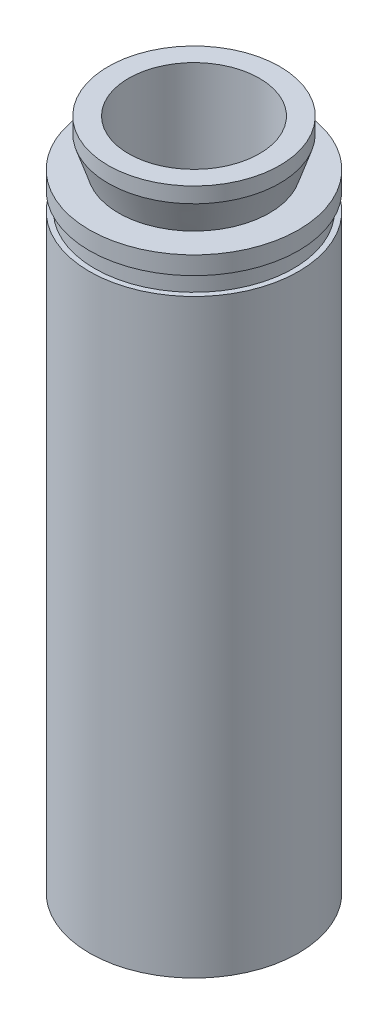
ISO-10303-21;
HEADER;
FILE_DESCRIPTION(('STEP AP214'),'2;1');
FILE_NAME('part.step','',(''),(''),'','','');
FILE_SCHEMA(('AUTOMOTIVE_DESIGN { 1 0 10303 214 1 1 1 1 }'));
ENDSEC;
DATA;
#1=APPLICATION_CONTEXT('core data for automotive mechanical design processes');
#2=APPLICATION_PROTOCOL_DEFINITION('international standard','automotive_design',2000,#1);
#3=PRODUCT_CONTEXT('',#1,'mechanical');
#4=PRODUCT('Part','Part','',(#3));
#5=PRODUCT_RELATED_PRODUCT_CATEGORY('part','',(#4));
#6=PRODUCT_DEFINITION_FORMATION('','',#4);
#7=PRODUCT_DEFINITION_CONTEXT('part definition',#1,'design');
#8=PRODUCT_DEFINITION('design','',#6,#7);
#9=PRODUCT_DEFINITION_SHAPE('','',#8);
#10=(LENGTH_UNIT() NAMED_UNIT(*) SI_UNIT(.MILLI.,.METRE.));
#11=(NAMED_UNIT(*) PLANE_ANGLE_UNIT() SI_UNIT($,.RADIAN.));
#12=(NAMED_UNIT(*) SI_UNIT($,.STERADIAN.) SOLID_ANGLE_UNIT());
#13=UNCERTAINTY_MEASURE_WITH_UNIT(LENGTH_MEASURE(1.E-05),#10,'distance_accuracy_value','');
#14=(GEOMETRIC_REPRESENTATION_CONTEXT(3) GLOBAL_UNCERTAINTY_ASSIGNED_CONTEXT((#13)) GLOBAL_UNIT_ASSIGNED_CONTEXT((#10,
#11,#12)) REPRESENTATION_CONTEXT('',''));
#15=CARTESIAN_POINT('',(0.,0.,0.));
#16=DIRECTION('',(0.,0.,1.));
#17=DIRECTION('',(1.,0.,0.));
#18=AXIS2_PLACEMENT_3D('',#15,#16,#17);
#19=CARTESIAN_POINT('',(0.,0.,0.));
#20=DIRECTION('',(0.,-1.,0.));
#21=DIRECTION('',(0.,0.,-1.));
#22=AXIS2_PLACEMENT_3D('',#19,#20,#21);
#23=CYLINDRICAL_SURFACE('',#22,20.3);
#24=CARTESIAN_POINT('',(0.,0.,0.));
#25=DIRECTION('',(0.,-1.,0.));
#26=DIRECTION('',(0.,0.,-1.));
#27=AXIS2_PLACEMENT_3D('',#24,#25,#26);
#28=CIRCLE('',#27,20.3);
#29=CARTESIAN_POINT('',(0.,0.,-20.3));
#30=VERTEX_POINT('',#29);
#31=EDGE_CURVE('E10',#30,#30,#28,.T.);
#32=ORIENTED_EDGE('',*,*,#31,.F.);
#33=EDGE_LOOP('',(#32));
#34=FACE_BOUND('',#33,.T.);
#35=CARTESIAN_POINT('',(0.,114.6,0.));
#36=DIRECTION('',(0.,-1.,0.));
#37=DIRECTION('',(0.,0.,-1.));
#38=AXIS2_PLACEMENT_3D('',#35,#36,#37);
#39=CIRCLE('',#38,20.3);
#40=CARTESIAN_POINT('',(0.,114.6,-20.3));
#41=VERTEX_POINT('',#40);
#42=EDGE_CURVE('E74',#41,#41,#39,.T.);
#43=ORIENTED_EDGE('',*,*,#42,.T.);
#44=EDGE_LOOP('',(#43));
#45=FACE_BOUND('',#44,.T.);
#46=ADVANCED_FACE('F31',(#34,#45),#23,.T.);
#47=CARTESIAN_POINT('',(-17.45,0.,0.));
#48=DIRECTION('',(0.,1.,0.));
#49=DIRECTION('',(0.,0.,1.));
#50=AXIS2_PLACEMENT_3D('',#47,#48,#49);
#51=PLANE('',#50);
#52=CARTESIAN_POINT('',(0.,0.,0.));
#53=DIRECTION('',(0.,-1.,0.));
#54=DIRECTION('',(0.,0.,-1.));
#55=AXIS2_PLACEMENT_3D('',#52,#53,#54);
#56=CIRCLE('',#55,17.45);
#57=CARTESIAN_POINT('',(0.,0.,-17.45));
#58=VERTEX_POINT('',#57);
#59=EDGE_CURVE('E37',#58,#58,#56,.T.);
#60=ORIENTED_EDGE('',*,*,#59,.F.);
#61=EDGE_LOOP('',(#60));
#62=FACE_BOUND('',#61,.T.);
#63=ORIENTED_EDGE('',*,*,#31,.T.);
#64=EDGE_LOOP('',(#63));
#65=FACE_BOUND('',#64,.T.);
#66=ADVANCED_FACE('F141',(#62,#65),#51,.F.);
#67=CARTESIAN_POINT('',(0.,0.,0.));
#68=DIRECTION('',(0.,-1.,0.));
#69=DIRECTION('',(0.,0.,-1.));
#70=AXIS2_PLACEMENT_3D('',#67,#68,#69);
#71=CYLINDRICAL_SURFACE('',#70,17.45);
#72=CARTESIAN_POINT('',(0.,111.6,0.));
#73=DIRECTION('',(0.,-1.,0.));
#74=DIRECTION('',(0.,0.,-1.));
#75=AXIS2_PLACEMENT_3D('',#72,#73,#74);
#76=CIRCLE('',#75,17.45);
#77=CARTESIAN_POINT('',(0.,111.6,-17.45));
#78=VERTEX_POINT('',#77);
#79=EDGE_CURVE('E41',#78,#78,#76,.T.);
#80=ORIENTED_EDGE('',*,*,#79,.F.);
#81=EDGE_LOOP('',(#80));
#82=FACE_BOUND('',#81,.T.);
#83=ORIENTED_EDGE('',*,*,#59,.T.);
#84=EDGE_LOOP('',(#83));
#85=FACE_BOUND('',#84,.T.);
#86=ADVANCED_FACE('F136',(#82,#85),#71,.F.);
#87=CARTESIAN_POINT('',(-17.45,111.6,0.));
#88=DIRECTION('',(0.,1.,0.));
#89=DIRECTION('',(0.,0.,1.));
#90=AXIS2_PLACEMENT_3D('',#87,#88,#89);
#91=PLANE('',#90);
#92=CARTESIAN_POINT('',(0.,111.6,0.));
#93=DIRECTION('',(0.,-1.,0.));
#94=DIRECTION('',(0.,0.,-1.));
#95=AXIS2_PLACEMENT_3D('',#92,#93,#94);
#96=CIRCLE('',#95,12.7);
#97=CARTESIAN_POINT('',(0.,111.6,-12.7));
#98=VERTEX_POINT('',#97);
#99=EDGE_CURVE('E45',#98,#98,#96,.T.);
#100=ORIENTED_EDGE('',*,*,#99,.F.);
#101=EDGE_LOOP('',(#100));
#102=FACE_BOUND('',#101,.T.);
#103=ORIENTED_EDGE('',*,*,#79,.T.);
#104=EDGE_LOOP('',(#103));
#105=FACE_BOUND('',#104,.T.);
#106=ADVANCED_FACE('F130',(#102,#105),#91,.F.);
#107=CARTESIAN_POINT('',(0.,0.,0.));
#108=DIRECTION('',(0.,-1.,0.));
#109=DIRECTION('',(0.,0.,-1.));
#110=AXIS2_PLACEMENT_3D('',#107,#108,#109);
#111=CYLINDRICAL_SURFACE('',#110,12.7);
#112=CARTESIAN_POINT('',(0.,130.6,0.));
#113=DIRECTION('',(0.,-1.,0.));
#114=DIRECTION('',(0.,0.,-1.));
#115=AXIS2_PLACEMENT_3D('',#112,#113,#114);
#116=CIRCLE('',#115,12.7);
#117=CARTESIAN_POINT('',(0.,130.6,-12.7));
#118=VERTEX_POINT('',#117);
#119=EDGE_CURVE('E50',#118,#118,#116,.T.);
#120=ORIENTED_EDGE('',*,*,#119,.F.);
#121=EDGE_LOOP('',(#120));
#122=FACE_BOUND('',#121,.T.);
#123=ORIENTED_EDGE('',*,*,#99,.T.);
#124=EDGE_LOOP('',(#123));
#125=FACE_BOUND('',#124,.T.);
#126=ADVANCED_FACE('F124',(#122,#125),#111,.F.);
#127=CARTESIAN_POINT('',(-16.65,130.6,0.));
#128=DIRECTION('',(0.,-1.,0.));
#129=DIRECTION('',(0.,0.,-1.));
#130=AXIS2_PLACEMENT_3D('',#127,#128,#129);
#131=PLANE('',#130);
#132=CARTESIAN_POINT('',(0.,130.6,0.));
#133=DIRECTION('',(0.,-1.,0.));
#134=DIRECTION('',(0.,0.,-1.));
#135=AXIS2_PLACEMENT_3D('',#132,#133,#134);
#136=CIRCLE('',#135,16.65);
#137=CARTESIAN_POINT('',(0.,130.6,-16.65));
#138=VERTEX_POINT('',#137);
#139=EDGE_CURVE('E53',#138,#138,#136,.T.);
#140=ORIENTED_EDGE('',*,*,#139,.F.);
#141=EDGE_LOOP('',(#140));
#142=FACE_BOUND('',#141,.T.);
#143=ORIENTED_EDGE('',*,*,#119,.T.);
#144=EDGE_LOOP('',(#143));
#145=FACE_BOUND('',#144,.T.);
#146=ADVANCED_FACE('F118',(#142,#145),#131,.F.);
#147=CARTESIAN_POINT('',(0.,0.,0.));
#148=DIRECTION('',(0.,-1.,0.));
#149=DIRECTION('',(0.,0.,-1.));
#150=AXIS2_PLACEMENT_3D('',#147,#148,#149);
#151=CYLINDRICAL_SURFACE('',#150,16.65);
#152=CARTESIAN_POINT('',(0.,127.6,0.));
#153=DIRECTION('',(0.,-1.,0.));
#154=DIRECTION('',(0.,0.,-1.));
#155=AXIS2_PLACEMENT_3D('',#152,#153,#154);
#156=CIRCLE('',#155,16.65);
#157=CARTESIAN_POINT('',(0.,127.6,-16.65));
#158=VERTEX_POINT('',#157);
#159=EDGE_CURVE('E56',#158,#158,#156,.T.);
#160=ORIENTED_EDGE('',*,*,#159,.F.);
#161=EDGE_LOOP('',(#160));
#162=FACE_BOUND('',#161,.T.);
#163=ORIENTED_EDGE('',*,*,#139,.T.);
#164=EDGE_LOOP('',(#163));
#165=FACE_BOUND('',#164,.T.);
#166=ADVANCED_FACE('F112',(#162,#165),#151,.T.);
#167=CARTESIAN_POINT('',(0.,127.6,0.));
#168=DIRECTION('',(0.,1.,0.));
#169=DIRECTION('',(0.,0.,1.));
#170=AXIS2_PLACEMENT_3D('',#167,#168,#169);
#171=CONICAL_SURFACE('',#170,16.65,0.321750554396643);
#172=CARTESIAN_POINT('',(0.,121.6,0.));
#173=DIRECTION('',(0.,-1.,0.));
#174=DIRECTION('',(0.,0.,-1.));
#175=AXIS2_PLACEMENT_3D('',#172,#173,#174);
#176=CIRCLE('',#175,14.65);
#177=CARTESIAN_POINT('',(0.,121.6,-14.65));
#178=VERTEX_POINT('',#177);
#179=EDGE_CURVE('E59',#178,#178,#176,.T.);
#180=ORIENTED_EDGE('',*,*,#179,.F.);
#181=EDGE_LOOP('',(#180));
#182=FACE_BOUND('',#181,.T.);
#183=ORIENTED_EDGE('',*,*,#159,.T.);
#184=EDGE_LOOP('',(#183));
#185=FACE_BOUND('',#184,.T.);
#186=ADVANCED_FACE('F106',(#182,#185),#171,.T.);
#187=CARTESIAN_POINT('',(-20.3,121.6,0.));
#188=DIRECTION('',(0.,-1.,0.));
#189=DIRECTION('',(0.,0.,-1.));
#190=AXIS2_PLACEMENT_3D('',#187,#188,#189);
#191=PLANE('',#190);
#192=CARTESIAN_POINT('',(0.,121.6,0.));
#193=DIRECTION('',(0.,-1.,0.));
#194=DIRECTION('',(0.,0.,-1.));
#195=AXIS2_PLACEMENT_3D('',#192,#193,#194);
#196=CIRCLE('',#195,20.3);
#197=CARTESIAN_POINT('',(0.,121.6,-20.3));
#198=VERTEX_POINT('',#197);
#199=EDGE_CURVE('E62',#198,#198,#196,.T.);
#200=ORIENTED_EDGE('',*,*,#199,.F.);
#201=EDGE_LOOP('',(#200));
#202=FACE_BOUND('',#201,.T.);
#203=ORIENTED_EDGE('',*,*,#179,.T.);
#204=EDGE_LOOP('',(#203));
#205=FACE_BOUND('',#204,.T.);
#206=ADVANCED_FACE('F100',(#202,#205),#191,.F.);
#207=CARTESIAN_POINT('',(0.,0.,0.));
#208=DIRECTION('',(0.,-1.,0.));
#209=DIRECTION('',(0.,0.,-1.));
#210=AXIS2_PLACEMENT_3D('',#207,#208,#209);
#211=CYLINDRICAL_SURFACE('',#210,20.3);
#212=CARTESIAN_POINT('',(0.,118.1,0.));
#213=DIRECTION('',(0.,-1.,0.));
#214=DIRECTION('',(0.,0.,-1.));
#215=AXIS2_PLACEMENT_3D('',#212,#213,#214);
#216=CIRCLE('',#215,20.3);
#217=CARTESIAN_POINT('',(0.,118.1,-20.3));
#218=VERTEX_POINT('',#217);
#219=EDGE_CURVE('E65',#218,#218,#216,.T.);
#220=ORIENTED_EDGE('',*,*,#219,.F.);
#221=EDGE_LOOP('',(#220));
#222=FACE_BOUND('',#221,.T.);
#223=ORIENTED_EDGE('',*,*,#199,.T.);
#224=EDGE_LOOP('',(#223));
#225=FACE_BOUND('',#224,.T.);
#226=ADVANCED_FACE('F94',(#222,#225),#211,.T.);
#227=CARTESIAN_POINT('',(-20.3,118.1,0.));
#228=DIRECTION('',(0.,1.,0.));
#229=DIRECTION('',(0.,0.,1.));
#230=AXIS2_PLACEMENT_3D('',#227,#228,#229);
#231=PLANE('',#230);
#232=CARTESIAN_POINT('',(0.,118.1,0.));
#233=DIRECTION('',(0.,-1.,0.));
#234=DIRECTION('',(0.,0.,-1.));
#235=AXIS2_PLACEMENT_3D('',#232,#233,#234);
#236=CIRCLE('',#235,19.3);
#237=CARTESIAN_POINT('',(0.,118.1,-19.3));
#238=VERTEX_POINT('',#237);
#239=EDGE_CURVE('E68',#238,#238,#236,.T.);
#240=ORIENTED_EDGE('',*,*,#239,.F.);
#241=EDGE_LOOP('',(#240));
#242=FACE_BOUND('',#241,.T.);
#243=ORIENTED_EDGE('',*,*,#219,.T.);
#244=EDGE_LOOP('',(#243));
#245=FACE_BOUND('',#244,.T.);
#246=ADVANCED_FACE('F88',(#242,#245),#231,.F.);
#247=CARTESIAN_POINT('',(0.,0.,0.));
#248=DIRECTION('',(0.,-1.,0.));
#249=DIRECTION('',(0.,0.,-1.));
#250=AXIS2_PLACEMENT_3D('',#247,#248,#249);
#251=CYLINDRICAL_SURFACE('',#250,19.3);
#252=CARTESIAN_POINT('',(0.,114.6,0.));
#253=DIRECTION('',(0.,-1.,0.));
#254=DIRECTION('',(0.,0.,-1.));
#255=AXIS2_PLACEMENT_3D('',#252,#253,#254);
#256=CIRCLE('',#255,19.3);
#257=CARTESIAN_POINT('',(0.,114.6,-19.3));
#258=VERTEX_POINT('',#257);
#259=EDGE_CURVE('E71',#258,#258,#256,.T.);
#260=ORIENTED_EDGE('',*,*,#259,.F.);
#261=EDGE_LOOP('',(#260));
#262=FACE_BOUND('',#261,.T.);
#263=ORIENTED_EDGE('',*,*,#239,.T.);
#264=EDGE_LOOP('',(#263));
#265=FACE_BOUND('',#264,.T.);
#266=ADVANCED_FACE('F82',(#262,#265),#251,.T.);
#267=CARTESIAN_POINT('',(-19.3,114.6,0.));
#268=DIRECTION('',(0.,-1.,0.));
#269=DIRECTION('',(0.,0.,-1.));
#270=AXIS2_PLACEMENT_3D('',#267,#268,#269);
#271=PLANE('',#270);
#272=ORIENTED_EDGE('',*,*,#42,.F.);
#273=EDGE_LOOP('',(#272));
#274=FACE_BOUND('',#273,.T.);
#275=ORIENTED_EDGE('',*,*,#259,.T.);
#276=EDGE_LOOP('',(#275));
#277=FACE_BOUND('',#276,.T.);
#278=ADVANCED_FACE('F79',(#274,#277),#271,.F.);
#279=CLOSED_SHELL('',(#46,#66,#86,#106,#126,#146,#166,#186,#206,#226,#246,#266,#278));
#280=MANIFOLD_SOLID_BREP('B2',#279);
#281=ADVANCED_BREP_SHAPE_REPRESENTATION('',(#18,#280),#14);
#282=SHAPE_DEFINITION_REPRESENTATION(#9,#281);
ENDSEC;
END-ISO-10303-21;
